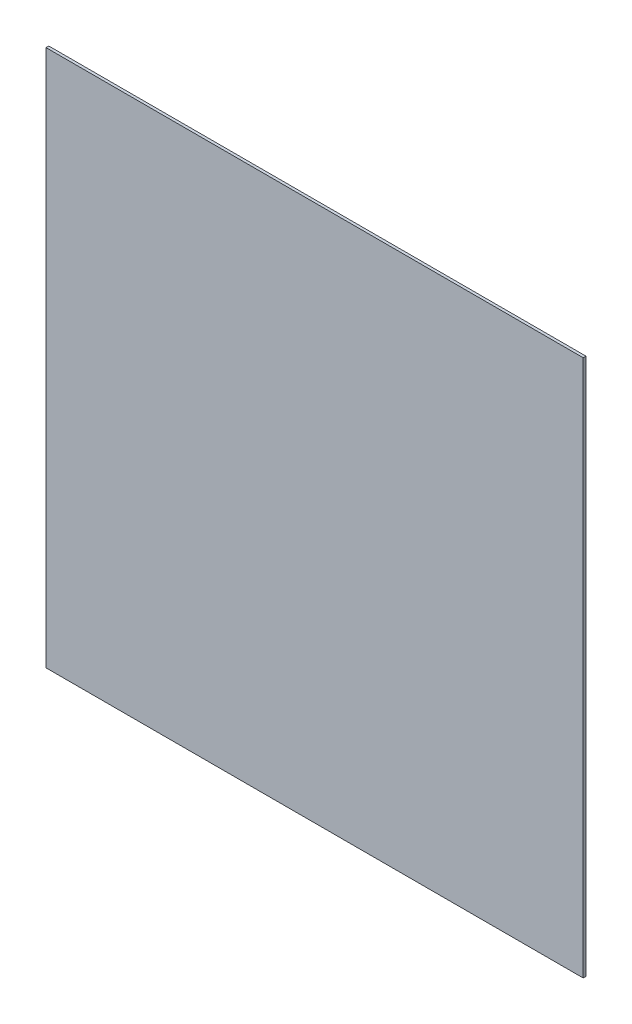
ISO-10303-21;
HEADER;
FILE_DESCRIPTION(('STEP AP214'),'2;1');
FILE_NAME('part.step','',(''),(''),'','','');
FILE_SCHEMA(('AUTOMOTIVE_DESIGN { 1 0 10303 214 1 1 1 1 }'));
ENDSEC;
DATA;
#1=APPLICATION_CONTEXT('core data for automotive mechanical design processes');
#2=APPLICATION_PROTOCOL_DEFINITION('international standard','automotive_design',2000,#1);
#3=PRODUCT_CONTEXT('',#1,'mechanical');
#4=PRODUCT('Part','Part','',(#3));
#5=PRODUCT_RELATED_PRODUCT_CATEGORY('part','',(#4));
#6=PRODUCT_DEFINITION_FORMATION('','',#4);
#7=PRODUCT_DEFINITION_CONTEXT('part definition',#1,'design');
#8=PRODUCT_DEFINITION('design','',#6,#7);
#9=PRODUCT_DEFINITION_SHAPE('','',#8);
#10=(LENGTH_UNIT() NAMED_UNIT(*) SI_UNIT(.MILLI.,.METRE.));
#11=(NAMED_UNIT(*) PLANE_ANGLE_UNIT() SI_UNIT($,.RADIAN.));
#12=(NAMED_UNIT(*) SI_UNIT($,.STERADIAN.) SOLID_ANGLE_UNIT());
#13=UNCERTAINTY_MEASURE_WITH_UNIT(LENGTH_MEASURE(1.E-05),#10,'distance_accuracy_value','');
#14=(GEOMETRIC_REPRESENTATION_CONTEXT(3) GLOBAL_UNCERTAINTY_ASSIGNED_CONTEXT((#13)) GLOBAL_UNIT_ASSIGNED_CONTEXT((#10,
#11,#12)) REPRESENTATION_CONTEXT('',''));
#15=CARTESIAN_POINT('',(0.,0.,0.));
#16=DIRECTION('',(0.,0.,1.));
#17=DIRECTION('',(1.,0.,0.));
#18=AXIS2_PLACEMENT_3D('',#15,#16,#17);
#19=CARTESIAN_POINT('',(194.,194.,0.));
#20=DIRECTION('',(0.,0.,1.));
#21=DIRECTION('',(1.,0.,0.));
#22=AXIS2_PLACEMENT_3D('',#19,#20,#21);
#23=PLANE('',#22);
#24=DIRECTION('',(0.,1.,0.));
#25=VECTOR('',#24,1.);
#26=CARTESIAN_POINT('',(0.,388.,0.));
#27=LINE('',#26,#25);
#28=CARTESIAN_POINT('',(0.,388.,0.));
#29=VERTEX_POINT('',#28);
#30=CARTESIAN_POINT('',(0.,0.,0.));
#31=VERTEX_POINT('',#30);
#32=EDGE_CURVE('E78',#29,#31,#27,.F.);
#33=ORIENTED_EDGE('',*,*,#32,.F.);
#34=DIRECTION('',(1.,0.,0.));
#35=VECTOR('',#34,1.);
#36=CARTESIAN_POINT('',(388.,388.,0.));
#37=LINE('',#36,#35);
#38=CARTESIAN_POINT('',(388.,388.,0.));
#39=VERTEX_POINT('',#38);
#40=EDGE_CURVE('E54',#39,#29,#37,.F.);
#41=ORIENTED_EDGE('',*,*,#40,.F.);
#42=DIRECTION('',(0.,1.,0.));
#43=VECTOR('',#42,1.);
#44=CARTESIAN_POINT('',(388.,0.,0.));
#45=LINE('',#44,#43);
#46=CARTESIAN_POINT('',(388.,0.,0.));
#47=VERTEX_POINT('',#46);
#48=EDGE_CURVE('E56',#47,#39,#45,.T.);
#49=ORIENTED_EDGE('',*,*,#48,.F.);
#50=DIRECTION('',(1.,0.,0.));
#51=VECTOR('',#50,1.);
#52=CARTESIAN_POINT('',(0.,0.,0.));
#53=LINE('',#52,#51);
#54=EDGE_CURVE('E19',#31,#47,#53,.T.);
#55=ORIENTED_EDGE('',*,*,#54,.F.);
#56=EDGE_LOOP('',(#33,#41,#49,#55));
#57=FACE_BOUND('',#56,.T.);
#58=ADVANCED_FACE('F16',(#57),#23,.F.);
#59=CARTESIAN_POINT('',(0.,0.,0.));
#60=DIRECTION('',(0.,-1.,0.));
#61=DIRECTION('',(0.,0.,-1.));
#62=AXIS2_PLACEMENT_3D('',#59,#60,#61);
#63=PLANE('',#62);
#64=DIRECTION('',(1.,0.,0.));
#65=VECTOR('',#64,1.);
#66=CARTESIAN_POINT('',(194.,0.,2.));
#67=LINE('',#66,#65);
#68=CARTESIAN_POINT('',(0.,0.,2.));
#69=VERTEX_POINT('',#68);
#70=CARTESIAN_POINT('',(388.,0.,2.));
#71=VERTEX_POINT('',#70);
#72=EDGE_CURVE('E82',#69,#71,#67,.T.);
#73=ORIENTED_EDGE('',*,*,#72,.F.);
#74=DIRECTION('',(0.,0.,1.));
#75=VECTOR('',#74,1.);
#76=CARTESIAN_POINT('',(0.,0.,0.));
#77=LINE('',#76,#75);
#78=EDGE_CURVE('E67',#31,#69,#77,.T.);
#79=ORIENTED_EDGE('',*,*,#78,.F.);
#80=ORIENTED_EDGE('',*,*,#54,.T.);
#81=DIRECTION('',(0.,0.,-1.));
#82=VECTOR('',#81,1.);
#83=CARTESIAN_POINT('',(388.,0.,0.));
#84=LINE('',#83,#82);
#85=EDGE_CURVE('E62',#71,#47,#84,.T.);
#86=ORIENTED_EDGE('',*,*,#85,.F.);
#87=EDGE_LOOP('',(#73,#79,#80,#86));
#88=FACE_BOUND('',#87,.T.);
#89=ADVANCED_FACE('F64',(#88),#63,.T.);
#90=CARTESIAN_POINT('',(388.,0.,0.));
#91=DIRECTION('',(1.,0.,0.));
#92=DIRECTION('',(0.,0.,-1.));
#93=AXIS2_PLACEMENT_3D('',#90,#91,#92);
#94=PLANE('',#93);
#95=DIRECTION('',(0.,1.,0.));
#96=VECTOR('',#95,1.);
#97=CARTESIAN_POINT('',(388.,194.,2.));
#98=LINE('',#97,#96);
#99=CARTESIAN_POINT('',(388.,388.,2.));
#100=VERTEX_POINT('',#99);
#101=EDGE_CURVE('E71',#71,#100,#98,.T.);
#102=ORIENTED_EDGE('',*,*,#101,.F.);
#103=ORIENTED_EDGE('',*,*,#85,.T.);
#104=ORIENTED_EDGE('',*,*,#48,.T.);
#105=DIRECTION('',(0.,0.,1.));
#106=VECTOR('',#105,1.);
#107=CARTESIAN_POINT('',(388.,388.,0.));
#108=LINE('',#107,#106);
#109=EDGE_CURVE('E74',#100,#39,#108,.F.);
#110=ORIENTED_EDGE('',*,*,#109,.F.);
#111=EDGE_LOOP('',(#102,#103,#104,#110));
#112=FACE_BOUND('',#111,.T.);
#113=ADVANCED_FACE('F69',(#112),#94,.T.);
#114=CARTESIAN_POINT('',(388.,388.,0.));
#115=DIRECTION('',(0.,1.,0.));
#116=DIRECTION('',(0.,0.,1.));
#117=AXIS2_PLACEMENT_3D('',#114,#115,#116);
#118=PLANE('',#117);
#119=DIRECTION('',(1.,0.,0.));
#120=VECTOR('',#119,1.);
#121=CARTESIAN_POINT('',(194.,388.,2.));
#122=LINE('',#121,#120);
#123=CARTESIAN_POINT('',(0.,388.,2.));
#124=VERTEX_POINT('',#123);
#125=EDGE_CURVE('E25',#100,#124,#122,.F.);
#126=ORIENTED_EDGE('',*,*,#125,.F.);
#127=ORIENTED_EDGE('',*,*,#109,.T.);
#128=ORIENTED_EDGE('',*,*,#40,.T.);
#129=DIRECTION('',(0.,0.,1.));
#130=VECTOR('',#129,1.);
#131=CARTESIAN_POINT('',(0.,388.,0.));
#132=LINE('',#131,#130);
#133=EDGE_CURVE('E34',#124,#29,#132,.F.);
#134=ORIENTED_EDGE('',*,*,#133,.F.);
#135=EDGE_LOOP('',(#126,#127,#128,#134));
#136=FACE_BOUND('',#135,.T.);
#137=ADVANCED_FACE('F88',(#136),#118,.T.);
#138=CARTESIAN_POINT('',(0.,388.,0.));
#139=DIRECTION('',(-1.,0.,0.));
#140=DIRECTION('',(0.,0.,1.));
#141=AXIS2_PLACEMENT_3D('',#138,#139,#140);
#142=PLANE('',#141);
#143=DIRECTION('',(0.,1.,0.));
#144=VECTOR('',#143,1.);
#145=CARTESIAN_POINT('',(0.,194.,2.));
#146=LINE('',#145,#144);
#147=EDGE_CURVE('E11',#124,#69,#146,.F.);
#148=ORIENTED_EDGE('',*,*,#147,.F.);
#149=ORIENTED_EDGE('',*,*,#133,.T.);
#150=ORIENTED_EDGE('',*,*,#32,.T.);
#151=ORIENTED_EDGE('',*,*,#78,.T.);
#152=EDGE_LOOP('',(#148,#149,#150,#151));
#153=FACE_BOUND('',#152,.T.);
#154=ADVANCED_FACE('F90',(#153),#142,.T.);
#155=CARTESIAN_POINT('',(194.,194.,2.));
#156=DIRECTION('',(0.,0.,1.));
#157=DIRECTION('',(1.,0.,0.));
#158=AXIS2_PLACEMENT_3D('',#155,#156,#157);
#159=PLANE('',#158);
#160=ORIENTED_EDGE('',*,*,#125,.T.);
#161=ORIENTED_EDGE('',*,*,#147,.T.);
#162=ORIENTED_EDGE('',*,*,#72,.T.);
#163=ORIENTED_EDGE('',*,*,#101,.T.);
#164=EDGE_LOOP('',(#160,#161,#162,#163));
#165=FACE_BOUND('',#164,.T.);
#166=ADVANCED_FACE('F87',(#165),#159,.T.);
#167=CLOSED_SHELL('',(#58,#89,#113,#137,#154,#166));
#168=MANIFOLD_SOLID_BREP('B1',#167);
#169=ADVANCED_BREP_SHAPE_REPRESENTATION('',(#18,#168),#14);
#170=SHAPE_DEFINITION_REPRESENTATION(#9,#169);
ENDSEC;
END-ISO-10303-21;
